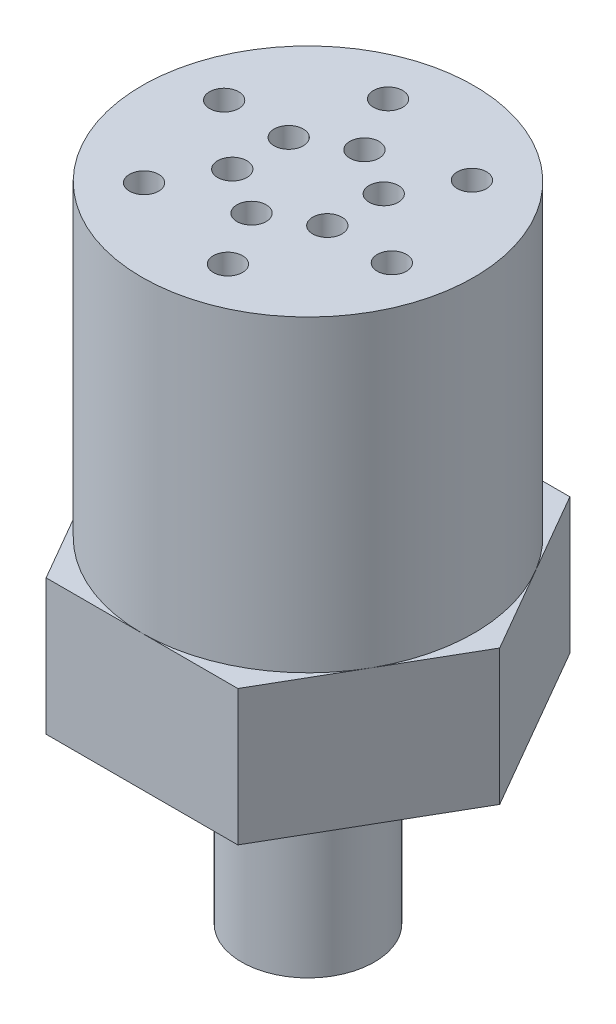
ISO-10303-21;
HEADER;
FILE_DESCRIPTION(('STEP AP214'),'2;1');
FILE_NAME('part.step','',(''),(''),'','','');
FILE_SCHEMA(('AUTOMOTIVE_DESIGN { 1 0 10303 214 1 1 1 1 }'));
ENDSEC;
DATA;
#1=APPLICATION_CONTEXT('core data for automotive mechanical design processes');
#2=APPLICATION_PROTOCOL_DEFINITION('international standard','automotive_design',2000,#1);
#3=PRODUCT_CONTEXT('',#1,'mechanical');
#4=PRODUCT('Part','Part','',(#3));
#5=PRODUCT_RELATED_PRODUCT_CATEGORY('part','',(#4));
#6=PRODUCT_DEFINITION_FORMATION('','',#4);
#7=PRODUCT_DEFINITION_CONTEXT('part definition',#1,'design');
#8=PRODUCT_DEFINITION('design','',#6,#7);
#9=PRODUCT_DEFINITION_SHAPE('','',#8);
#10=(LENGTH_UNIT() NAMED_UNIT(*) SI_UNIT(.MILLI.,.METRE.));
#11=(NAMED_UNIT(*) PLANE_ANGLE_UNIT() SI_UNIT($,.RADIAN.));
#12=(NAMED_UNIT(*) SI_UNIT($,.STERADIAN.) SOLID_ANGLE_UNIT());
#13=UNCERTAINTY_MEASURE_WITH_UNIT(LENGTH_MEASURE(1.E-05),#10,'distance_accuracy_value','');
#14=(GEOMETRIC_REPRESENTATION_CONTEXT(3) GLOBAL_UNCERTAINTY_ASSIGNED_CONTEXT((#13)) GLOBAL_UNIT_ASSIGNED_CONTEXT((#10,
#11,#12)) REPRESENTATION_CONTEXT('',''));
#15=CARTESIAN_POINT('',(0.,0.,0.));
#16=DIRECTION('',(0.,0.,1.));
#17=DIRECTION('',(1.,0.,0.));
#18=AXIS2_PLACEMENT_3D('',#15,#16,#17);
#19=CARTESIAN_POINT('',(0.,-32.004,0.));
#20=DIRECTION('',(0.,1.,0.));
#21=DIRECTION('',(0.,0.,1.));
#22=AXIS2_PLACEMENT_3D('',#19,#20,#21);
#23=CYLINDRICAL_SURFACE('',#22,6.35);
#24=CARTESIAN_POINT('',(0.,-32.004,0.));
#25=DIRECTION('',(0.,-1.,0.));
#26=DIRECTION('',(0.,0.,-1.));
#27=AXIS2_PLACEMENT_3D('',#24,#25,#26);
#28=CIRCLE('',#27,6.35);
#29=CARTESIAN_POINT('',(0.,-32.004,-6.35));
#30=VERTEX_POINT('',#29);
#31=EDGE_CURVE('E11',#30,#30,#28,.T.);
#32=ORIENTED_EDGE('',*,*,#31,.F.);
#33=EDGE_LOOP('',(#32));
#34=FACE_BOUND('',#33,.T.);
#35=CARTESIAN_POINT('',(0.,-12.954,0.));
#36=DIRECTION('',(0.,-1.,0.));
#37=DIRECTION('',(0.,0.,-1.));
#38=AXIS2_PLACEMENT_3D('',#35,#36,#37);
#39=CIRCLE('',#38,6.35);
#40=CARTESIAN_POINT('',(0.,-12.954,-6.35));
#41=VERTEX_POINT('',#40);
#42=EDGE_CURVE('E46',#41,#41,#39,.T.);
#43=ORIENTED_EDGE('',*,*,#42,.T.);
#44=EDGE_LOOP('',(#43));
#45=FACE_BOUND('',#44,.T.);
#46=ADVANCED_FACE('F43',(#34,#45),#23,.T.);
#47=CARTESIAN_POINT('',(0.,-32.004,0.));
#48=DIRECTION('',(0.,-1.,0.));
#49=DIRECTION('',(0.,0.,-1.));
#50=AXIS2_PLACEMENT_3D('',#47,#48,#49);
#51=PLANE('',#50);
#52=ORIENTED_EDGE('',*,*,#31,.T.);
#53=EDGE_LOOP('',(#52));
#54=FACE_BOUND('',#53,.T.);
#55=ADVANCED_FACE('F58',(#54),#51,.T.);
#56=CARTESIAN_POINT('',(0.,-12.954,0.));
#57=DIRECTION('',(0.,-1.,0.));
#58=DIRECTION('',(0.,0.,-1.));
#59=AXIS2_PLACEMENT_3D('',#56,#57,#58);
#60=PLANE('',#59);
#61=ORIENTED_EDGE('',*,*,#42,.F.);
#62=EDGE_LOOP('',(#61));
#63=FACE_BOUND('',#62,.T.);
#64=ADVANCED_FACE('F56',(#63),#60,.F.);
#65=CLOSED_SHELL('',(#46,#55,#64));
#66=MANIFOLD_SOLID_BREP('B2',#65);
#67=CARTESIAN_POINT('',(-9.16543552338534,-12.954,15.875));
#68=DIRECTION('',(0.,0.,1.));
#69=DIRECTION('',(1.,0.,0.));
#70=AXIS2_PLACEMENT_3D('',#67,#68,#69);
#71=PLANE('',#70);
#72=DIRECTION('',(1.,0.,0.));
#73=VECTOR('',#72,1.);
#74=CARTESIAN_POINT('',(-9.16543552338534,0.,15.875));
#75=LINE('',#74,#73);
#76=CARTESIAN_POINT('',(-9.16543552338534,0.,15.875));
#77=VERTEX_POINT('',#76);
#78=CARTESIAN_POINT('',(9.16543552338533,0.,15.875));
#79=VERTEX_POINT('',#78);
#80=EDGE_CURVE('E188',#77,#79,#75,.T.);
#81=ORIENTED_EDGE('',*,*,#80,.F.);
#82=DIRECTION('',(0.,1.,0.));
#83=VECTOR('',#82,1.);
#84=CARTESIAN_POINT('',(-9.16543552338534,-12.954,15.875));
#85=LINE('',#84,#83);
#86=CARTESIAN_POINT('',(-9.16543552338534,-12.954,15.875));
#87=VERTEX_POINT('',#86);
#88=EDGE_CURVE('E41',#87,#77,#85,.T.);
#89=ORIENTED_EDGE('',*,*,#88,.F.);
#90=DIRECTION('',(1.,0.,0.));
#91=VECTOR('',#90,1.);
#92=CARTESIAN_POINT('',(-9.16543552338534,-12.954,15.875));
#93=LINE('',#92,#91);
#94=CARTESIAN_POINT('',(9.16543552338533,-12.954,15.875));
#95=VERTEX_POINT('',#94);
#96=EDGE_CURVE('E202',#87,#95,#93,.T.);
#97=ORIENTED_EDGE('',*,*,#96,.T.);
#98=DIRECTION('',(0.,1.,0.));
#99=VECTOR('',#98,1.);
#100=CARTESIAN_POINT('',(9.16543552338533,-12.954,15.875));
#101=LINE('',#100,#99);
#102=EDGE_CURVE('E106',#95,#79,#101,.T.);
#103=ORIENTED_EDGE('',*,*,#102,.T.);
#104=EDGE_LOOP('',(#81,#89,#97,#103));
#105=FACE_BOUND('',#104,.T.);
#106=ADVANCED_FACE('F103',(#105),#71,.T.);
#107=CARTESIAN_POINT('',(-18.3308710467706,-12.954,0.));
#108=DIRECTION('',(-0.86602540378444,0.,0.499999999999998));
#109=DIRECTION('',(0.499999999999998,0.,0.86602540378444));
#110=AXIS2_PLACEMENT_3D('',#107,#108,#109);
#111=PLANE('',#110);
#112=DIRECTION('',(0.499999999999998,0.,0.86602540378444));
#113=VECTOR('',#112,1.);
#114=CARTESIAN_POINT('',(-18.3308710467706,0.,0.));
#115=LINE('',#114,#113);
#116=CARTESIAN_POINT('',(-18.3308710467706,0.,0.));
#117=VERTEX_POINT('',#116);
#118=EDGE_CURVE('E200',#117,#77,#115,.T.);
#119=ORIENTED_EDGE('',*,*,#118,.F.);
#120=DIRECTION('',(0.,1.,0.));
#121=VECTOR('',#120,1.);
#122=CARTESIAN_POINT('',(-18.3308710467706,-12.954,0.));
#123=LINE('',#122,#121);
#124=CARTESIAN_POINT('',(-18.3308710467706,-12.954,0.));
#125=VERTEX_POINT('',#124);
#126=EDGE_CURVE('E112',#125,#117,#123,.T.);
#127=ORIENTED_EDGE('',*,*,#126,.F.);
#128=DIRECTION('',(0.499999999999998,0.,0.86602540378444));
#129=VECTOR('',#128,1.);
#130=CARTESIAN_POINT('',(-18.3308710467706,-12.954,0.));
#131=LINE('',#130,#129);
#132=EDGE_CURVE('E178',#125,#87,#131,.T.);
#133=ORIENTED_EDGE('',*,*,#132,.T.);
#134=ORIENTED_EDGE('',*,*,#88,.T.);
#135=EDGE_LOOP('',(#119,#127,#133,#134));
#136=FACE_BOUND('',#135,.T.);
#137=ADVANCED_FACE('F210',(#136),#111,.T.);
#138=CARTESIAN_POINT('',(-9.16543552338536,-12.954,-15.875));
#139=DIRECTION('',(-0.86602540378444,0.,-0.499999999999997));
#140=DIRECTION('',(-0.499999999999997,0.,0.86602540378444));
#141=AXIS2_PLACEMENT_3D('',#138,#139,#140);
#142=PLANE('',#141);
#143=DIRECTION('',(-0.499999999999997,0.,0.86602540378444));
#144=VECTOR('',#143,1.);
#145=CARTESIAN_POINT('',(-9.16543552338536,0.,-15.875));
#146=LINE('',#145,#144);
#147=CARTESIAN_POINT('',(-9.16543552338536,0.,-15.875));
#148=VERTEX_POINT('',#147);
#149=EDGE_CURVE('E165',#148,#117,#146,.T.);
#150=ORIENTED_EDGE('',*,*,#149,.F.);
#151=DIRECTION('',(0.,1.,0.));
#152=VECTOR('',#151,1.);
#153=CARTESIAN_POINT('',(-9.16543552338536,-12.954,-15.875));
#154=LINE('',#153,#152);
#155=CARTESIAN_POINT('',(-9.16543552338536,-12.954,-15.875));
#156=VERTEX_POINT('',#155);
#157=EDGE_CURVE('E160',#156,#148,#154,.T.);
#158=ORIENTED_EDGE('',*,*,#157,.F.);
#159=DIRECTION('',(-0.499999999999997,0.,0.86602540378444));
#160=VECTOR('',#159,1.);
#161=CARTESIAN_POINT('',(-9.16543552338536,-12.954,-15.875));
#162=LINE('',#161,#160);
#163=EDGE_CURVE('E163',#156,#125,#162,.T.);
#164=ORIENTED_EDGE('',*,*,#163,.T.);
#165=ORIENTED_EDGE('',*,*,#126,.T.);
#166=EDGE_LOOP('',(#150,#158,#164,#165));
#167=FACE_BOUND('',#166,.T.);
#168=ADVANCED_FACE('F162',(#167),#142,.T.);
#169=CARTESIAN_POINT('',(9.16543552338536,-12.954,-15.875));
#170=DIRECTION('',(0.,0.,-1.));
#171=DIRECTION('',(-1.,0.,0.));
#172=AXIS2_PLACEMENT_3D('',#169,#170,#171);
#173=PLANE('',#172);
#174=DIRECTION('',(-1.,0.,0.));
#175=VECTOR('',#174,1.);
#176=CARTESIAN_POINT('',(9.16543552338536,0.,-15.875));
#177=LINE('',#176,#175);
#178=CARTESIAN_POINT('',(9.16543552338536,0.,-15.875));
#179=VERTEX_POINT('',#178);
#180=EDGE_CURVE('E197',#179,#148,#177,.T.);
#181=ORIENTED_EDGE('',*,*,#180,.F.);
#182=DIRECTION('',(0.,1.,0.));
#183=VECTOR('',#182,1.);
#184=CARTESIAN_POINT('',(9.16543552338536,-12.954,-15.875));
#185=LINE('',#184,#183);
#186=CARTESIAN_POINT('',(9.16543552338536,-12.954,-15.875));
#187=VERTEX_POINT('',#186);
#188=EDGE_CURVE('E170',#187,#179,#185,.T.);
#189=ORIENTED_EDGE('',*,*,#188,.F.);
#190=DIRECTION('',(-1.,0.,0.));
#191=VECTOR('',#190,1.);
#192=CARTESIAN_POINT('',(9.16543552338536,-12.954,-15.875));
#193=LINE('',#192,#191);
#194=EDGE_CURVE('E176',#187,#156,#193,.T.);
#195=ORIENTED_EDGE('',*,*,#194,.T.);
#196=ORIENTED_EDGE('',*,*,#157,.T.);
#197=EDGE_LOOP('',(#181,#189,#195,#196));
#198=FACE_BOUND('',#197,.T.);
#199=ADVANCED_FACE('F180',(#198),#173,.T.);
#200=CARTESIAN_POINT('',(18.3308710467706,-12.954,0.));
#201=DIRECTION('',(0.866025403784441,0.,-0.499999999999997));
#202=DIRECTION('',(-0.499999999999997,0.,-0.866025403784441));
#203=AXIS2_PLACEMENT_3D('',#200,#201,#202);
#204=PLANE('',#203);
#205=DIRECTION('',(-0.499999999999997,0.,-0.866025403784441));
#206=VECTOR('',#205,1.);
#207=CARTESIAN_POINT('',(18.3308710467706,0.,0.));
#208=LINE('',#207,#206);
#209=CARTESIAN_POINT('',(18.3308710467706,0.,0.));
#210=VERTEX_POINT('',#209);
#211=EDGE_CURVE('E194',#210,#179,#208,.T.);
#212=ORIENTED_EDGE('',*,*,#211,.F.);
#213=DIRECTION('',(0.,1.,0.));
#214=VECTOR('',#213,1.);
#215=CARTESIAN_POINT('',(18.3308710467706,-12.954,0.));
#216=LINE('',#215,#214);
#217=CARTESIAN_POINT('',(18.3308710467706,-12.954,0.));
#218=VERTEX_POINT('',#217);
#219=EDGE_CURVE('E205',#218,#210,#216,.T.);
#220=ORIENTED_EDGE('',*,*,#219,.F.);
#221=DIRECTION('',(-0.499999999999997,0.,-0.866025403784441));
#222=VECTOR('',#221,1.);
#223=CARTESIAN_POINT('',(18.3308710467706,-12.954,0.));
#224=LINE('',#223,#222);
#225=EDGE_CURVE('E181',#218,#187,#224,.T.);
#226=ORIENTED_EDGE('',*,*,#225,.T.);
#227=ORIENTED_EDGE('',*,*,#188,.T.);
#228=EDGE_LOOP('',(#212,#220,#226,#227));
#229=FACE_BOUND('',#228,.T.);
#230=ADVANCED_FACE('F223',(#229),#204,.T.);
#231=CARTESIAN_POINT('',(9.16543552338533,-12.954,15.875));
#232=DIRECTION('',(0.86602540378444,0.,0.499999999999998));
#233=DIRECTION('',(0.499999999999998,0.,-0.86602540378444));
#234=AXIS2_PLACEMENT_3D('',#231,#232,#233);
#235=PLANE('',#234);
#236=DIRECTION('',(0.499999999999998,0.,-0.86602540378444));
#237=VECTOR('',#236,1.);
#238=CARTESIAN_POINT('',(9.16543552338533,0.,15.875));
#239=LINE('',#238,#237);
#240=EDGE_CURVE('E191',#79,#210,#239,.T.);
#241=ORIENTED_EDGE('',*,*,#240,.F.);
#242=ORIENTED_EDGE('',*,*,#102,.F.);
#243=DIRECTION('',(0.499999999999998,0.,-0.86602540378444));
#244=VECTOR('',#243,1.);
#245=CARTESIAN_POINT('',(9.16543552338533,-12.954,15.875));
#246=LINE('',#245,#244);
#247=EDGE_CURVE('E183',#95,#218,#246,.T.);
#248=ORIENTED_EDGE('',*,*,#247,.T.);
#249=ORIENTED_EDGE('',*,*,#219,.T.);
#250=EDGE_LOOP('',(#241,#242,#248,#249));
#251=FACE_BOUND('',#250,.T.);
#252=ADVANCED_FACE('F207',(#251),#235,.T.);
#253=CARTESIAN_POINT('',(0.,-12.954,0.));
#254=DIRECTION('',(0.,1.,0.));
#255=DIRECTION('',(0.,0.,1.));
#256=AXIS2_PLACEMENT_3D('',#253,#254,#255);
#257=PLANE('',#256);
#258=ORIENTED_EDGE('',*,*,#96,.F.);
#259=ORIENTED_EDGE('',*,*,#132,.F.);
#260=ORIENTED_EDGE('',*,*,#163,.F.);
#261=ORIENTED_EDGE('',*,*,#194,.F.);
#262=ORIENTED_EDGE('',*,*,#225,.F.);
#263=ORIENTED_EDGE('',*,*,#247,.F.);
#264=EDGE_LOOP('',(#258,#259,#260,#261,#262,#263));
#265=FACE_BOUND('',#264,.T.);
#266=ADVANCED_FACE('F174',(#265),#257,.F.);
#267=CARTESIAN_POINT('',(0.,0.,0.));
#268=DIRECTION('',(0.,1.,0.));
#269=DIRECTION('',(0.,0.,1.));
#270=AXIS2_PLACEMENT_3D('',#267,#268,#269);
#271=PLANE('',#270);
#272=ORIENTED_EDGE('',*,*,#80,.T.);
#273=ORIENTED_EDGE('',*,*,#240,.T.);
#274=ORIENTED_EDGE('',*,*,#211,.T.);
#275=ORIENTED_EDGE('',*,*,#180,.T.);
#276=ORIENTED_EDGE('',*,*,#149,.T.);
#277=ORIENTED_EDGE('',*,*,#118,.T.);
#278=EDGE_LOOP('',(#272,#273,#274,#275,#276,#277));
#279=FACE_BOUND('',#278,.T.);
#280=ADVANCED_FACE('F209',(#279),#271,.T.);
#281=CLOSED_SHELL('',(#106,#137,#168,#199,#230,#252,#266,#280));
#282=MANIFOLD_SOLID_BREP('B6',#281);
#283=CARTESIAN_POINT('',(0.,29.464,0.));
#284=DIRECTION('',(0.,-1.,0.));
#285=DIRECTION('',(0.,0.,-1.));
#286=AXIS2_PLACEMENT_3D('',#283,#284,#285);
#287=CYLINDRICAL_SURFACE('',#286,15.875);
#288=CARTESIAN_POINT('',(0.,29.464,0.));
#289=DIRECTION('',(0.,1.,0.));
#290=DIRECTION('',(0.,0.,1.));
#291=AXIS2_PLACEMENT_3D('',#288,#289,#290);
#292=CIRCLE('',#291,15.875);
#293=CARTESIAN_POINT('',(0.,29.464,15.875));
#294=VERTEX_POINT('',#293);
#295=EDGE_CURVE('E102',#294,#294,#292,.T.);
#296=ORIENTED_EDGE('',*,*,#295,.F.);
#297=EDGE_LOOP('',(#296));
#298=FACE_BOUND('',#297,.T.);
#299=CARTESIAN_POINT('',(0.,0.,0.));
#300=DIRECTION('',(0.,1.,0.));
#301=DIRECTION('',(0.,0.,1.));
#302=AXIS2_PLACEMENT_3D('',#299,#300,#301);
#303=CIRCLE('',#302,15.875);
#304=CARTESIAN_POINT('',(0.,0.,15.875));
#305=VERTEX_POINT('',#304);
#306=EDGE_CURVE('E308',#305,#305,#303,.T.);
#307=ORIENTED_EDGE('',*,*,#306,.T.);
#308=EDGE_LOOP('',(#307));
#309=FACE_BOUND('',#308,.T.);
#310=ADVANCED_FACE('F305',(#298,#309),#287,.T.);
#311=CARTESIAN_POINT('',(0.,29.464,0.));
#312=DIRECTION('',(0.,1.,0.));
#313=DIRECTION('',(0.,0.,1.));
#314=AXIS2_PLACEMENT_3D('',#311,#312,#313);
#315=PLANE('',#314);
#316=CARTESIAN_POINT('',(4.64605379522904,29.464,-2.59632743312842));
#317=DIRECTION('',(0.,1.,0.));
#318=DIRECTION('',(0.,0.,1.));
#319=AXIS2_PLACEMENT_3D('',#316,#317,#318);
#320=CIRCLE('',#319,1.397);
#321=CARTESIAN_POINT('',(4.64605379522904,29.464,-1.19932743312842));
#322=VERTEX_POINT('',#321);
#323=EDGE_CURVE('E383',#322,#322,#320,.T.);
#324=ORIENTED_EDGE('',*,*,#323,.F.);
#325=EDGE_LOOP('',(#324));
#326=FACE_BOUND('',#325,.T.);
#327=CARTESIAN_POINT('',(7.7327980736064,29.464,-7.94272535325039));
#328=DIRECTION('',(0.,1.,0.));
#329=DIRECTION('',(0.,0.,1.));
#330=AXIS2_PLACEMENT_3D('',#327,#328,#329);
#331=CIRCLE('',#330,1.397);
#332=CARTESIAN_POINT('',(7.7327980736064,29.464,-6.54572535325039));
#333=VERTEX_POINT('',#332);
#334=EDGE_CURVE('E377',#333,#333,#331,.T.);
#335=ORIENTED_EDGE('',*,*,#334,.F.);
#336=EDGE_LOOP('',(#335));
#337=FACE_BOUND('',#336,.T.);
#338=CARTESIAN_POINT('',(0.0745413839828577,29.464,-5.32176433058166));
#339=DIRECTION('',(0.,1.,0.));
#340=DIRECTION('',(0.,0.,1.));
#341=AXIS2_PLACEMENT_3D('',#338,#339,#340);
#342=CIRCLE('',#341,1.397);
#343=CARTESIAN_POINT('',(0.0745413839828577,29.464,-3.92476433058166));
#344=VERTEX_POINT('',#343);
#345=EDGE_CURVE('E371',#344,#344,#342,.T.);
#346=ORIENTED_EDGE('',*,*,#345,.F.);
#347=EDGE_LOOP('',(#346));
#348=FACE_BOUND('',#347,.T.);
#349=CARTESIAN_POINT('',(-3.01220289439439,29.464,-10.6681622507037));
#350=DIRECTION('',(0.,1.,0.));
#351=DIRECTION('',(0.,0.,1.));
#352=AXIS2_PLACEMENT_3D('',#349,#350,#351);
#353=CIRCLE('',#352,1.397);
#354=CARTESIAN_POINT('',(-3.01220289439439,29.464,-9.27116225070369));
#355=VERTEX_POINT('',#354);
#356=EDGE_CURVE('E365',#355,#355,#353,.T.);
#357=ORIENTED_EDGE('',*,*,#356,.F.);
#358=EDGE_LOOP('',(#357));
#359=FACE_BOUND('',#358,.T.);
#360=CARTESIAN_POINT('',(-4.57151241124618,29.464,-2.72543689745322));
#361=DIRECTION('',(0.,1.,0.));
#362=DIRECTION('',(0.,0.,1.));
#363=AXIS2_PLACEMENT_3D('',#360,#361,#362);
#364=CIRCLE('',#363,1.397);
#365=CARTESIAN_POINT('',(-4.57151241124618,29.464,-1.32843689745323));
#366=VERTEX_POINT('',#365);
#367=EDGE_CURVE('E359',#366,#366,#364,.T.);
#368=ORIENTED_EDGE('',*,*,#367,.F.);
#369=EDGE_LOOP('',(#368));
#370=FACE_BOUND('',#369,.T.);
#371=CARTESIAN_POINT('',(-10.7450009680008,29.464,-2.72543689745327));
#372=DIRECTION('',(0.,1.,0.));
#373=DIRECTION('',(0.,0.,1.));
#374=AXIS2_PLACEMENT_3D('',#371,#372,#373);
#375=CIRCLE('',#374,1.397);
#376=CARTESIAN_POINT('',(-10.7450009680008,29.464,-1.32843689745327));
#377=VERTEX_POINT('',#376);
#378=EDGE_CURVE('E353',#377,#377,#375,.T.);
#379=ORIENTED_EDGE('',*,*,#378,.F.);
#380=EDGE_LOOP('',(#379));
#381=FACE_BOUND('',#380,.T.);
#382=CARTESIAN_POINT('',(-4.64605379522902,29.464,2.59632743312845));
#383=DIRECTION('',(0.,1.,0.));
#384=DIRECTION('',(0.,0.,1.));
#385=AXIS2_PLACEMENT_3D('',#382,#383,#384);
#386=CIRCLE('',#385,1.397);
#387=CARTESIAN_POINT('',(-4.64605379522902,29.464,3.99332743312845));
#388=VERTEX_POINT('',#387);
#389=EDGE_CURVE('E347',#388,#388,#386,.T.);
#390=ORIENTED_EDGE('',*,*,#389,.F.);
#391=EDGE_LOOP('',(#390));
#392=FACE_BOUND('',#391,.T.);
#393=CARTESIAN_POINT('',(-7.73279807360634,29.464,7.94272535325044));
#394=DIRECTION('',(0.,1.,0.));
#395=DIRECTION('',(0.,0.,1.));
#396=AXIS2_PLACEMENT_3D('',#393,#394,#395);
#397=CIRCLE('',#396,1.397);
#398=CARTESIAN_POINT('',(-7.73279807360634,29.464,9.33972535325044));
#399=VERTEX_POINT('',#398);
#400=EDGE_CURVE('E341',#399,#399,#397,.T.);
#401=ORIENTED_EDGE('',*,*,#400,.F.);
#402=EDGE_LOOP('',(#401));
#403=FACE_BOUND('',#402,.T.);
#404=CARTESIAN_POINT('',(-0.0745413839828204,29.464,5.32176433058166));
#405=DIRECTION('',(0.,1.,0.));
#406=DIRECTION('',(0.,0.,1.));
#407=AXIS2_PLACEMENT_3D('',#404,#405,#406);
#408=CIRCLE('',#407,1.397);
#409=CARTESIAN_POINT('',(-0.0745413839828204,29.464,6.71876433058166));
#410=VERTEX_POINT('',#409);
#411=EDGE_CURVE('E335',#410,#410,#408,.T.);
#412=ORIENTED_EDGE('',*,*,#411,.F.);
#413=EDGE_LOOP('',(#412));
#414=FACE_BOUND('',#413,.T.);
#415=CARTESIAN_POINT('',(3.01220289439446,29.464,10.6681622507037));
#416=DIRECTION('',(0.,1.,0.));
#417=DIRECTION('',(0.,0.,1.));
#418=AXIS2_PLACEMENT_3D('',#415,#416,#417);
#419=CIRCLE('',#418,1.397);
#420=CARTESIAN_POINT('',(3.01220289439446,29.464,12.0651622507037));
#421=VERTEX_POINT('',#420);
#422=EDGE_CURVE('E329',#421,#421,#419,.T.);
#423=ORIENTED_EDGE('',*,*,#422,.F.);
#424=EDGE_LOOP('',(#423));
#425=FACE_BOUND('',#424,.T.);
#426=CARTESIAN_POINT('',(4.5715124112462,29.464,2.72543689745319));
#427=DIRECTION('',(0.,1.,0.));
#428=DIRECTION('',(0.,0.,1.));
#429=AXIS2_PLACEMENT_3D('',#426,#427,#428);
#430=CIRCLE('',#429,1.397);
#431=CARTESIAN_POINT('',(4.5715124112462,29.464,4.12243689745319));
#432=VERTEX_POINT('',#431);
#433=EDGE_CURVE('E323',#432,#432,#430,.T.);
#434=ORIENTED_EDGE('',*,*,#433,.F.);
#435=EDGE_LOOP('',(#434));
#436=FACE_BOUND('',#435,.T.);
#437=CARTESIAN_POINT('',(10.7450009680008,29.464,2.72543689745319));
#438=DIRECTION('',(0.,1.,0.));
#439=DIRECTION('',(0.,0.,1.));
#440=AXIS2_PLACEMENT_3D('',#437,#438,#439);
#441=CIRCLE('',#440,1.397);
#442=CARTESIAN_POINT('',(10.7450009680008,29.464,4.12243689745319));
#443=VERTEX_POINT('',#442);
#444=EDGE_CURVE('E317',#443,#443,#441,.T.);
#445=ORIENTED_EDGE('',*,*,#444,.F.);
#446=EDGE_LOOP('',(#445));
#447=FACE_BOUND('',#446,.T.);
#448=ORIENTED_EDGE('',*,*,#295,.T.);
#449=EDGE_LOOP('',(#448));
#450=FACE_BOUND('',#449,.T.);
#451=ADVANCED_FACE('F398',(#326,#337,#348,#359,#370,#381,#392,#403,#414,#425,#436,#447,#450),
#315,.T.);
#452=CARTESIAN_POINT('',(0.,0.,0.));
#453=DIRECTION('',(0.,1.,0.));
#454=DIRECTION('',(0.,0.,1.));
#455=AXIS2_PLACEMENT_3D('',#452,#453,#454);
#456=PLANE('',#455);
#457=ORIENTED_EDGE('',*,*,#306,.F.);
#458=EDGE_LOOP('',(#457));
#459=FACE_BOUND('',#458,.T.);
#460=ADVANCED_FACE('F401',(#459),#456,.F.);
#461=CARTESIAN_POINT('',(10.7450009680008,19.304,2.72543689745319));
#462=DIRECTION('',(0.,1.,0.));
#463=DIRECTION('',(0.,0.,1.));
#464=AXIS2_PLACEMENT_3D('',#461,#462,#463);
#465=CYLINDRICAL_SURFACE('',#464,1.397);
#466=CARTESIAN_POINT('',(10.7450009680008,19.304,2.72543689745319));
#467=DIRECTION('',(0.,1.,0.));
#468=DIRECTION('',(0.,0.,1.));
#469=AXIS2_PLACEMENT_3D('',#466,#467,#468);
#470=CIRCLE('',#469,1.397);
#471=CARTESIAN_POINT('',(10.7450009680008,19.304,4.12243689745319));
#472=VERTEX_POINT('',#471);
#473=EDGE_CURVE('E315',#472,#472,#470,.T.);
#474=ORIENTED_EDGE('',*,*,#473,.F.);
#475=EDGE_LOOP('',(#474));
#476=FACE_BOUND('',#475,.T.);
#477=ORIENTED_EDGE('',*,*,#444,.T.);
#478=EDGE_LOOP('',(#477));
#479=FACE_BOUND('',#478,.T.);
#480=ADVANCED_FACE('F425',(#476,#479),#465,.F.);
#481=CARTESIAN_POINT('',(10.7450009680008,19.304,2.72543689745319));
#482=DIRECTION('',(0.,1.,0.));
#483=DIRECTION('',(0.,0.,1.));
#484=AXIS2_PLACEMENT_3D('',#481,#482,#483);
#485=PLANE('',#484);
#486=ORIENTED_EDGE('',*,*,#473,.T.);
#487=EDGE_LOOP('',(#486));
#488=FACE_BOUND('',#487,.T.);
#489=ADVANCED_FACE('F427',(#488),#485,.T.);
#490=CARTESIAN_POINT('',(4.5715124112462,19.304,2.72543689745319));
#491=DIRECTION('',(0.,1.,0.));
#492=DIRECTION('',(0.,0.,1.));
#493=AXIS2_PLACEMENT_3D('',#490,#491,#492);
#494=CYLINDRICAL_SURFACE('',#493,1.397);
#495=CARTESIAN_POINT('',(4.5715124112462,19.304,2.72543689745319));
#496=DIRECTION('',(0.,1.,0.));
#497=DIRECTION('',(0.,0.,1.));
#498=AXIS2_PLACEMENT_3D('',#495,#496,#497);
#499=CIRCLE('',#498,1.397);
#500=CARTESIAN_POINT('',(4.5715124112462,19.304,4.12243689745319));
#501=VERTEX_POINT('',#500);
#502=EDGE_CURVE('E320',#501,#501,#499,.T.);
#503=ORIENTED_EDGE('',*,*,#502,.F.);
#504=EDGE_LOOP('',(#503));
#505=FACE_BOUND('',#504,.T.);
#506=ORIENTED_EDGE('',*,*,#433,.T.);
#507=EDGE_LOOP('',(#506));
#508=FACE_BOUND('',#507,.T.);
#509=ADVANCED_FACE('F434',(#505,#508),#494,.F.);
#510=CARTESIAN_POINT('',(4.5715124112462,19.304,2.72543689745319));
#511=DIRECTION('',(0.,1.,0.));
#512=DIRECTION('',(0.,0.,1.));
#513=AXIS2_PLACEMENT_3D('',#510,#511,#512);
#514=PLANE('',#513);
#515=ORIENTED_EDGE('',*,*,#502,.T.);
#516=EDGE_LOOP('',(#515));
#517=FACE_BOUND('',#516,.T.);
#518=ADVANCED_FACE('F491',(#517),#514,.T.);
#519=CARTESIAN_POINT('',(3.01220289439446,19.304,10.6681622507037));
#520=DIRECTION('',(0.,1.,0.));
#521=DIRECTION('',(0.,0.,1.));
#522=AXIS2_PLACEMENT_3D('',#519,#520,#521);
#523=CYLINDRICAL_SURFACE('',#522,1.397);
#524=CARTESIAN_POINT('',(3.01220289439446,19.304,10.6681622507037));
#525=DIRECTION('',(0.,1.,0.));
#526=DIRECTION('',(0.,0.,1.));
#527=AXIS2_PLACEMENT_3D('',#524,#525,#526);
#528=CIRCLE('',#527,1.397);
#529=CARTESIAN_POINT('',(3.01220289439446,19.304,12.0651622507037));
#530=VERTEX_POINT('',#529);
#531=EDGE_CURVE('E326',#530,#530,#528,.T.);
#532=ORIENTED_EDGE('',*,*,#531,.F.);
#533=EDGE_LOOP('',(#532));
#534=FACE_BOUND('',#533,.T.);
#535=ORIENTED_EDGE('',*,*,#422,.T.);
#536=EDGE_LOOP('',(#535));
#537=FACE_BOUND('',#536,.T.);
#538=ADVANCED_FACE('F500',(#534,#537),#523,.F.);
#539=CARTESIAN_POINT('',(3.01220289439446,19.304,10.6681622507037));
#540=DIRECTION('',(0.,1.,0.));
#541=DIRECTION('',(0.,0.,1.));
#542=AXIS2_PLACEMENT_3D('',#539,#540,#541);
#543=PLANE('',#542);
#544=ORIENTED_EDGE('',*,*,#531,.T.);
#545=EDGE_LOOP('',(#544));
#546=FACE_BOUND('',#545,.T.);
#547=ADVANCED_FACE('F509',(#546),#543,.T.);
#548=CARTESIAN_POINT('',(-0.0745413839828204,19.304,5.32176433058166));
#549=DIRECTION('',(0.,1.,0.));
#550=DIRECTION('',(0.,0.,1.));
#551=AXIS2_PLACEMENT_3D('',#548,#549,#550);
#552=CYLINDRICAL_SURFACE('',#551,1.397);
#553=CARTESIAN_POINT('',(-0.0745413839828204,19.304,5.32176433058166));
#554=DIRECTION('',(0.,1.,0.));
#555=DIRECTION('',(0.,0.,1.));
#556=AXIS2_PLACEMENT_3D('',#553,#554,#555);
#557=CIRCLE('',#556,1.397);
#558=CARTESIAN_POINT('',(-0.0745413839828204,19.304,6.71876433058166));
#559=VERTEX_POINT('',#558);
#560=EDGE_CURVE('E332',#559,#559,#557,.T.);
#561=ORIENTED_EDGE('',*,*,#560,.F.);
#562=EDGE_LOOP('',(#561));
#563=FACE_BOUND('',#562,.T.);
#564=ORIENTED_EDGE('',*,*,#411,.T.);
#565=EDGE_LOOP('',(#564));
#566=FACE_BOUND('',#565,.T.);
#567=ADVANCED_FACE('F518',(#563,#566),#552,.F.);
#568=CARTESIAN_POINT('',(-0.0745413839828204,19.304,5.32176433058166));
#569=DIRECTION('',(0.,1.,0.));
#570=DIRECTION('',(0.,0.,1.));
#571=AXIS2_PLACEMENT_3D('',#568,#569,#570);
#572=PLANE('',#571);
#573=ORIENTED_EDGE('',*,*,#560,.T.);
#574=EDGE_LOOP('',(#573));
#575=FACE_BOUND('',#574,.T.);
#576=ADVANCED_FACE('F527',(#575),#572,.T.);
#577=CARTESIAN_POINT('',(-7.73279807360634,19.304,7.94272535325044));
#578=DIRECTION('',(0.,1.,0.));
#579=DIRECTION('',(0.,0.,1.));
#580=AXIS2_PLACEMENT_3D('',#577,#578,#579);
#581=CYLINDRICAL_SURFACE('',#580,1.397);
#582=CARTESIAN_POINT('',(-7.73279807360634,19.304,7.94272535325044));
#583=DIRECTION('',(0.,1.,0.));
#584=DIRECTION('',(0.,0.,1.));
#585=AXIS2_PLACEMENT_3D('',#582,#583,#584);
#586=CIRCLE('',#585,1.397);
#587=CARTESIAN_POINT('',(-7.73279807360634,19.304,9.33972535325044));
#588=VERTEX_POINT('',#587);
#589=EDGE_CURVE('E338',#588,#588,#586,.T.);
#590=ORIENTED_EDGE('',*,*,#589,.F.);
#591=EDGE_LOOP('',(#590));
#592=FACE_BOUND('',#591,.T.);
#593=ORIENTED_EDGE('',*,*,#400,.T.);
#594=EDGE_LOOP('',(#593));
#595=FACE_BOUND('',#594,.T.);
#596=ADVANCED_FACE('F536',(#592,#595),#581,.F.);
#597=CARTESIAN_POINT('',(-7.73279807360634,19.304,7.94272535325044));
#598=DIRECTION('',(0.,1.,0.));
#599=DIRECTION('',(0.,0.,1.));
#600=AXIS2_PLACEMENT_3D('',#597,#598,#599);
#601=PLANE('',#600);
#602=ORIENTED_EDGE('',*,*,#589,.T.);
#603=EDGE_LOOP('',(#602));
#604=FACE_BOUND('',#603,.T.);
#605=ADVANCED_FACE('F545',(#604),#601,.T.);
#606=CARTESIAN_POINT('',(-4.64605379522902,19.304,2.59632743312845));
#607=DIRECTION('',(0.,1.,0.));
#608=DIRECTION('',(0.,0.,1.));
#609=AXIS2_PLACEMENT_3D('',#606,#607,#608);
#610=CYLINDRICAL_SURFACE('',#609,1.397);
#611=CARTESIAN_POINT('',(-4.64605379522902,19.304,2.59632743312845));
#612=DIRECTION('',(0.,1.,0.));
#613=DIRECTION('',(0.,0.,1.));
#614=AXIS2_PLACEMENT_3D('',#611,#612,#613);
#615=CIRCLE('',#614,1.397);
#616=CARTESIAN_POINT('',(-4.64605379522902,19.304,3.99332743312845));
#617=VERTEX_POINT('',#616);
#618=EDGE_CURVE('E344',#617,#617,#615,.T.);
#619=ORIENTED_EDGE('',*,*,#618,.F.);
#620=EDGE_LOOP('',(#619));
#621=FACE_BOUND('',#620,.T.);
#622=ORIENTED_EDGE('',*,*,#389,.T.);
#623=EDGE_LOOP('',(#622));
#624=FACE_BOUND('',#623,.T.);
#625=ADVANCED_FACE('F554',(#621,#624),#610,.F.);
#626=CARTESIAN_POINT('',(-4.64605379522902,19.304,2.59632743312845));
#627=DIRECTION('',(0.,1.,0.));
#628=DIRECTION('',(0.,0.,1.));
#629=AXIS2_PLACEMENT_3D('',#626,#627,#628);
#630=PLANE('',#629);
#631=ORIENTED_EDGE('',*,*,#618,.T.);
#632=EDGE_LOOP('',(#631));
#633=FACE_BOUND('',#632,.T.);
#634=ADVANCED_FACE('F563',(#633),#630,.T.);
#635=CARTESIAN_POINT('',(-10.7450009680008,19.304,-2.72543689745327));
#636=DIRECTION('',(0.,1.,0.));
#637=DIRECTION('',(0.,0.,1.));
#638=AXIS2_PLACEMENT_3D('',#635,#636,#637);
#639=CYLINDRICAL_SURFACE('',#638,1.397);
#640=CARTESIAN_POINT('',(-10.7450009680008,19.304,-2.72543689745327));
#641=DIRECTION('',(0.,1.,0.));
#642=DIRECTION('',(0.,0.,1.));
#643=AXIS2_PLACEMENT_3D('',#640,#641,#642);
#644=CIRCLE('',#643,1.397);
#645=CARTESIAN_POINT('',(-10.7450009680008,19.304,-1.32843689745327));
#646=VERTEX_POINT('',#645);
#647=EDGE_CURVE('E350',#646,#646,#644,.T.);
#648=ORIENTED_EDGE('',*,*,#647,.F.);
#649=EDGE_LOOP('',(#648));
#650=FACE_BOUND('',#649,.T.);
#651=ORIENTED_EDGE('',*,*,#378,.T.);
#652=EDGE_LOOP('',(#651));
#653=FACE_BOUND('',#652,.T.);
#654=ADVANCED_FACE('F572',(#650,#653),#639,.F.);
#655=CARTESIAN_POINT('',(-10.7450009680008,19.304,-2.72543689745327));
#656=DIRECTION('',(0.,1.,0.));
#657=DIRECTION('',(0.,0.,1.));
#658=AXIS2_PLACEMENT_3D('',#655,#656,#657);
#659=PLANE('',#658);
#660=ORIENTED_EDGE('',*,*,#647,.T.);
#661=EDGE_LOOP('',(#660));
#662=FACE_BOUND('',#661,.T.);
#663=ADVANCED_FACE('F581',(#662),#659,.T.);
#664=CARTESIAN_POINT('',(-4.57151241124618,19.304,-2.72543689745322));
#665=DIRECTION('',(0.,1.,0.));
#666=DIRECTION('',(0.,0.,1.));
#667=AXIS2_PLACEMENT_3D('',#664,#665,#666);
#668=CYLINDRICAL_SURFACE('',#667,1.397);
#669=CARTESIAN_POINT('',(-4.57151241124618,19.304,-2.72543689745322));
#670=DIRECTION('',(0.,1.,0.));
#671=DIRECTION('',(0.,0.,1.));
#672=AXIS2_PLACEMENT_3D('',#669,#670,#671);
#673=CIRCLE('',#672,1.397);
#674=CARTESIAN_POINT('',(-4.57151241124618,19.304,-1.32843689745323));
#675=VERTEX_POINT('',#674);
#676=EDGE_CURVE('E356',#675,#675,#673,.T.);
#677=ORIENTED_EDGE('',*,*,#676,.F.);
#678=EDGE_LOOP('',(#677));
#679=FACE_BOUND('',#678,.T.);
#680=ORIENTED_EDGE('',*,*,#367,.T.);
#681=EDGE_LOOP('',(#680));
#682=FACE_BOUND('',#681,.T.);
#683=ADVANCED_FACE('F590',(#679,#682),#668,.F.);
#684=CARTESIAN_POINT('',(-4.57151241124618,19.304,-2.72543689745322));
#685=DIRECTION('',(0.,1.,0.));
#686=DIRECTION('',(0.,0.,1.));
#687=AXIS2_PLACEMENT_3D('',#684,#685,#686);
#688=PLANE('',#687);
#689=ORIENTED_EDGE('',*,*,#676,.T.);
#690=EDGE_LOOP('',(#689));
#691=FACE_BOUND('',#690,.T.);
#692=ADVANCED_FACE('F599',(#691),#688,.T.);
#693=CARTESIAN_POINT('',(-3.01220289439439,19.304,-10.6681622507037));
#694=DIRECTION('',(0.,1.,0.));
#695=DIRECTION('',(0.,0.,1.));
#696=AXIS2_PLACEMENT_3D('',#693,#694,#695);
#697=CYLINDRICAL_SURFACE('',#696,1.397);
#698=CARTESIAN_POINT('',(-3.01220289439439,19.304,-10.6681622507037));
#699=DIRECTION('',(0.,1.,0.));
#700=DIRECTION('',(0.,0.,1.));
#701=AXIS2_PLACEMENT_3D('',#698,#699,#700);
#702=CIRCLE('',#701,1.397);
#703=CARTESIAN_POINT('',(-3.01220289439439,19.304,-9.27116225070369));
#704=VERTEX_POINT('',#703);
#705=EDGE_CURVE('E362',#704,#704,#702,.T.);
#706=ORIENTED_EDGE('',*,*,#705,.F.);
#707=EDGE_LOOP('',(#706));
#708=FACE_BOUND('',#707,.T.);
#709=ORIENTED_EDGE('',*,*,#356,.T.);
#710=EDGE_LOOP('',(#709));
#711=FACE_BOUND('',#710,.T.);
#712=ADVANCED_FACE('F608',(#708,#711),#697,.F.);
#713=CARTESIAN_POINT('',(-3.01220289439439,19.304,-10.6681622507037));
#714=DIRECTION('',(0.,1.,0.));
#715=DIRECTION('',(0.,0.,1.));
#716=AXIS2_PLACEMENT_3D('',#713,#714,#715);
#717=PLANE('',#716);
#718=ORIENTED_EDGE('',*,*,#705,.T.);
#719=EDGE_LOOP('',(#718));
#720=FACE_BOUND('',#719,.T.);
#721=ADVANCED_FACE('F617',(#720),#717,.T.);
#722=CARTESIAN_POINT('',(0.0745413839828577,19.304,-5.32176433058166));
#723=DIRECTION('',(0.,1.,0.));
#724=DIRECTION('',(0.,0.,1.));
#725=AXIS2_PLACEMENT_3D('',#722,#723,#724);
#726=CYLINDRICAL_SURFACE('',#725,1.397);
#727=CARTESIAN_POINT('',(0.0745413839828577,19.304,-5.32176433058166));
#728=DIRECTION('',(0.,1.,0.));
#729=DIRECTION('',(0.,0.,1.));
#730=AXIS2_PLACEMENT_3D('',#727,#728,#729);
#731=CIRCLE('',#730,1.397);
#732=CARTESIAN_POINT('',(0.0745413839828577,19.304,-3.92476433058166));
#733=VERTEX_POINT('',#732);
#734=EDGE_CURVE('E368',#733,#733,#731,.T.);
#735=ORIENTED_EDGE('',*,*,#734,.F.);
#736=EDGE_LOOP('',(#735));
#737=FACE_BOUND('',#736,.T.);
#738=ORIENTED_EDGE('',*,*,#345,.T.);
#739=EDGE_LOOP('',(#738));
#740=FACE_BOUND('',#739,.T.);
#741=ADVANCED_FACE('F626',(#737,#740),#726,.F.);
#742=CARTESIAN_POINT('',(0.0745413839828577,19.304,-5.32176433058166));
#743=DIRECTION('',(0.,1.,0.));
#744=DIRECTION('',(0.,0.,1.));
#745=AXIS2_PLACEMENT_3D('',#742,#743,#744);
#746=PLANE('',#745);
#747=ORIENTED_EDGE('',*,*,#734,.T.);
#748=EDGE_LOOP('',(#747));
#749=FACE_BOUND('',#748,.T.);
#750=ADVANCED_FACE('F635',(#749),#746,.T.);
#751=CARTESIAN_POINT('',(7.7327980736064,19.304,-7.94272535325039));
#752=DIRECTION('',(0.,1.,0.));
#753=DIRECTION('',(0.,0.,1.));
#754=AXIS2_PLACEMENT_3D('',#751,#752,#753);
#755=CYLINDRICAL_SURFACE('',#754,1.397);
#756=CARTESIAN_POINT('',(7.7327980736064,19.304,-7.94272535325039));
#757=DIRECTION('',(0.,1.,0.));
#758=DIRECTION('',(0.,0.,1.));
#759=AXIS2_PLACEMENT_3D('',#756,#757,#758);
#760=CIRCLE('',#759,1.397);
#761=CARTESIAN_POINT('',(7.7327980736064,19.304,-6.54572535325039));
#762=VERTEX_POINT('',#761);
#763=EDGE_CURVE('E374',#762,#762,#760,.T.);
#764=ORIENTED_EDGE('',*,*,#763,.F.);
#765=EDGE_LOOP('',(#764));
#766=FACE_BOUND('',#765,.T.);
#767=ORIENTED_EDGE('',*,*,#334,.T.);
#768=EDGE_LOOP('',(#767));
#769=FACE_BOUND('',#768,.T.);
#770=ADVANCED_FACE('F644',(#766,#769),#755,.F.);
#771=CARTESIAN_POINT('',(7.7327980736064,19.304,-7.94272535325039));
#772=DIRECTION('',(0.,1.,0.));
#773=DIRECTION('',(0.,0.,1.));
#774=AXIS2_PLACEMENT_3D('',#771,#772,#773);
#775=PLANE('',#774);
#776=ORIENTED_EDGE('',*,*,#763,.T.);
#777=EDGE_LOOP('',(#776));
#778=FACE_BOUND('',#777,.T.);
#779=ADVANCED_FACE('F394',(#778),#775,.T.);
#780=CARTESIAN_POINT('',(4.64605379522904,19.304,-2.59632743312842));
#781=DIRECTION('',(0.,1.,0.));
#782=DIRECTION('',(0.,0.,1.));
#783=AXIS2_PLACEMENT_3D('',#780,#781,#782);
#784=CYLINDRICAL_SURFACE('',#783,1.397);
#785=CARTESIAN_POINT('',(4.64605379522904,19.304,-2.59632743312842));
#786=DIRECTION('',(0.,1.,0.));
#787=DIRECTION('',(0.,0.,1.));
#788=AXIS2_PLACEMENT_3D('',#785,#786,#787);
#789=CIRCLE('',#788,1.397);
#790=CARTESIAN_POINT('',(4.64605379522904,19.304,-1.19932743312842));
#791=VERTEX_POINT('',#790);
#792=EDGE_CURVE('E380',#791,#791,#789,.T.);
#793=ORIENTED_EDGE('',*,*,#792,.F.);
#794=EDGE_LOOP('',(#793));
#795=FACE_BOUND('',#794,.T.);
#796=ORIENTED_EDGE('',*,*,#323,.T.);
#797=EDGE_LOOP('',(#796));
#798=FACE_BOUND('',#797,.T.);
#799=ADVANCED_FACE('F391',(#795,#798),#784,.F.);
#800=CARTESIAN_POINT('',(4.64605379522904,19.304,-2.59632743312842));
#801=DIRECTION('',(0.,1.,0.));
#802=DIRECTION('',(0.,0.,1.));
#803=AXIS2_PLACEMENT_3D('',#800,#801,#802);
#804=PLANE('',#803);
#805=ORIENTED_EDGE('',*,*,#792,.T.);
#806=EDGE_LOOP('',(#805));
#807=FACE_BOUND('',#806,.T.);
#808=ADVANCED_FACE('F389',(#807),#804,.T.);
#809=CLOSED_SHELL('',(#310,#451,#460,#480,#489,#509,#518,#538,#547,#567,#576,#596,#605,#625,
#634,#654,#663,#683,#692,#712,#721,#741,#750,#770,#779,#799,#808));
#810=MANIFOLD_SOLID_BREP('B35',#809);
#811=ADVANCED_BREP_SHAPE_REPRESENTATION('',(#18,#66,#282,#810),#14);
#812=SHAPE_DEFINITION_REPRESENTATION(#9,#811);
ENDSEC;
END-ISO-10303-21;
